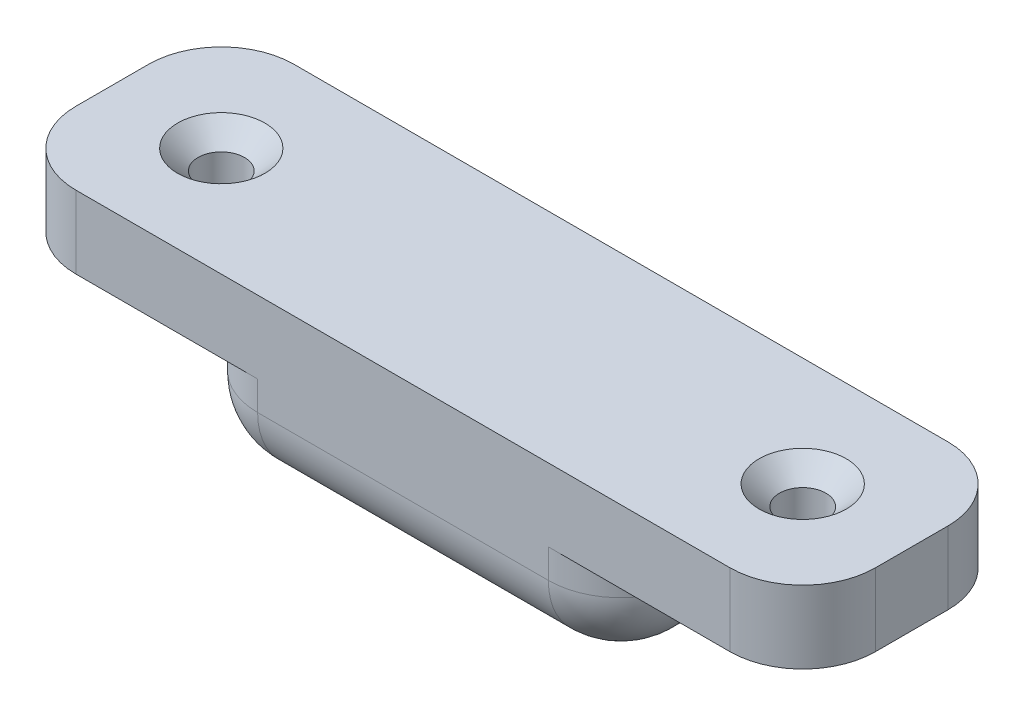
ISO-10303-21;
HEADER;
FILE_DESCRIPTION(('STEP AP214'),'2;1');
FILE_NAME('part.step','',(''),(''),'','','');
FILE_SCHEMA(('AUTOMOTIVE_DESIGN { 1 0 10303 214 1 1 1 1 }'));
ENDSEC;
DATA;
#1=APPLICATION_CONTEXT('core data for automotive mechanical design processes');
#2=APPLICATION_PROTOCOL_DEFINITION('international standard','automotive_design',2000,#1);
#3=PRODUCT_CONTEXT('',#1,'mechanical');
#4=PRODUCT('Part','Part','',(#3));
#5=PRODUCT_RELATED_PRODUCT_CATEGORY('part','',(#4));
#6=PRODUCT_DEFINITION_FORMATION('','',#4);
#7=PRODUCT_DEFINITION_CONTEXT('part definition',#1,'design');
#8=PRODUCT_DEFINITION('design','',#6,#7);
#9=PRODUCT_DEFINITION_SHAPE('','',#8);
#10=(LENGTH_UNIT() NAMED_UNIT(*) SI_UNIT(.MILLI.,.METRE.));
#11=(NAMED_UNIT(*) PLANE_ANGLE_UNIT() SI_UNIT($,.RADIAN.));
#12=(NAMED_UNIT(*) SI_UNIT($,.STERADIAN.) SOLID_ANGLE_UNIT());
#13=UNCERTAINTY_MEASURE_WITH_UNIT(LENGTH_MEASURE(1.E-05),#10,'distance_accuracy_value','');
#14=(GEOMETRIC_REPRESENTATION_CONTEXT(3) GLOBAL_UNCERTAINTY_ASSIGNED_CONTEXT((#13)) GLOBAL_UNIT_ASSIGNED_CONTEXT((#10,
#11,#12)) REPRESENTATION_CONTEXT('',''));
#15=CARTESIAN_POINT('',(0.,0.,0.));
#16=DIRECTION('',(0.,0.,1.));
#17=DIRECTION('',(1.,0.,0.));
#18=AXIS2_PLACEMENT_3D('',#15,#16,#17);
#19=CARTESIAN_POINT('',(-27.5,6.,15.));
#20=DIRECTION('',(1.,0.,0.));
#21=DIRECTION('',(0.,0.,-1.));
#22=AXIS2_PLACEMENT_3D('',#19,#20,#21);
#23=PLANE('',#22);
#24=DIRECTION('',(0.,0.,-1.));
#25=VECTOR('',#24,1.);
#26=CARTESIAN_POINT('',(-27.5,6.,15.));
#27=LINE('',#26,#25);
#28=CARTESIAN_POINT('',(-27.5,6.,10.));
#29=VERTEX_POINT('',#28);
#30=CARTESIAN_POINT('',(-27.5,6.,5.));
#31=VERTEX_POINT('',#30);
#32=EDGE_CURVE('E314',#29,#31,#27,.T.);
#33=ORIENTED_EDGE('',*,*,#32,.T.);
#34=DIRECTION('',(0.,-1.,0.));
#35=VECTOR('',#34,1.);
#36=CARTESIAN_POINT('',(-27.5,6.,5.));
#37=LINE('',#36,#35);
#38=CARTESIAN_POINT('',(-27.5,0.999999999999996,5.));
#39=VERTEX_POINT('',#38);
#40=EDGE_CURVE('E205',#31,#39,#37,.T.);
#41=ORIENTED_EDGE('',*,*,#40,.T.);
#42=DIRECTION('',(0.,0.,-1.));
#43=VECTOR('',#42,1.);
#44=CARTESIAN_POINT('',(-27.5,0.999999999999996,15.));
#45=LINE('',#44,#43);
#46=CARTESIAN_POINT('',(-27.5,0.999999999999996,10.));
#47=VERTEX_POINT('',#46);
#48=EDGE_CURVE('E329',#47,#39,#45,.T.);
#49=ORIENTED_EDGE('',*,*,#48,.F.);
#50=DIRECTION('',(0.,-1.,0.));
#51=VECTOR('',#50,1.);
#52=CARTESIAN_POINT('',(-27.5,6.,10.));
#53=LINE('',#52,#51);
#54=EDGE_CURVE('E203',#47,#29,#53,.F.);
#55=ORIENTED_EDGE('',*,*,#54,.T.);
#56=EDGE_LOOP('',(#33,#41,#49,#55));
#57=FACE_BOUND('',#56,.T.);
#58=ADVANCED_FACE('F34',(#57),#23,.F.);
#59=CARTESIAN_POINT('',(-27.5,0.999999999999996,15.));
#60=DIRECTION('',(0.,1.,0.));
#61=DIRECTION('',(0.,0.,1.));
#62=AXIS2_PLACEMENT_3D('',#59,#60,#61);
#63=PLANE('',#62);
#64=CARTESIAN_POINT('',(-20.,0.999999999999997,7.5));
#65=DIRECTION('',(0.,1.,0.));
#66=DIRECTION('',(0.,0.,1.));
#67=AXIS2_PLACEMENT_3D('',#64,#65,#66);
#68=CIRCLE('',#67,1.6);
#69=CARTESIAN_POINT('',(-20.,0.999999999999997,9.1));
#70=VERTEX_POINT('',#69);
#71=EDGE_CURVE('E297',#70,#70,#68,.T.);
#72=ORIENTED_EDGE('',*,*,#71,.T.);
#73=EDGE_LOOP('',(#72));
#74=FACE_BOUND('',#73,.T.);
#75=ORIENTED_EDGE('',*,*,#48,.T.);
#76=CARTESIAN_POINT('',(-22.5,0.999999999999997,5.));
#77=DIRECTION('',(0.,1.,0.));
#78=DIRECTION('',(0.,0.,1.));
#79=AXIS2_PLACEMENT_3D('',#76,#77,#78);
#80=CIRCLE('',#79,5.);
#81=CARTESIAN_POINT('',(-22.5,0.999999999999996,0.));
#82=VERTEX_POINT('',#81);
#83=EDGE_CURVE('E210',#39,#82,#80,.F.);
#84=ORIENTED_EDGE('',*,*,#83,.T.);
#85=DIRECTION('',(1.,0.,0.));
#86=VECTOR('',#85,1.);
#87=CARTESIAN_POINT('',(-27.5,0.999999999999996,0.));
#88=LINE('',#87,#86);
#89=CARTESIAN_POINT('',(-10.,0.999999999999996,0.));
#90=VERTEX_POINT('',#89);
#91=EDGE_CURVE('E315',#82,#90,#88,.T.);
#92=ORIENTED_EDGE('',*,*,#91,.T.);
#93=CARTESIAN_POINT('',(-10.,0.999999999999996,5.));
#94=DIRECTION('',(0.,1.,0.));
#95=DIRECTION('',(0.,0.,1.));
#96=AXIS2_PLACEMENT_3D('',#93,#94,#95);
#97=CIRCLE('',#96,5.);
#98=CARTESIAN_POINT('',(-15.,0.999999999999996,5.));
#99=VERTEX_POINT('',#98);
#100=EDGE_CURVE('E43',#90,#99,#97,.T.);
#101=ORIENTED_EDGE('',*,*,#100,.T.);
#102=DIRECTION('',(0.,0.,-1.));
#103=VECTOR('',#102,1.);
#104=CARTESIAN_POINT('',(-15.,0.999999999999996,15.));
#105=LINE('',#104,#103);
#106=CARTESIAN_POINT('',(-15.,0.999999999999996,10.));
#107=VERTEX_POINT('',#106);
#108=EDGE_CURVE('E182',#107,#99,#105,.T.);
#109=ORIENTED_EDGE('',*,*,#108,.F.);
#110=CARTESIAN_POINT('',(-10.,0.999999999999996,10.));
#111=DIRECTION('',(0.,1.,0.));
#112=DIRECTION('',(0.,0.,1.));
#113=AXIS2_PLACEMENT_3D('',#110,#111,#112);
#114=CIRCLE('',#113,5.);
#115=CARTESIAN_POINT('',(-10.,0.999999999999996,15.));
#116=VERTEX_POINT('',#115);
#117=EDGE_CURVE('E11',#107,#116,#114,.T.);
#118=ORIENTED_EDGE('',*,*,#117,.T.);
#119=DIRECTION('',(1.,0.,0.));
#120=VECTOR('',#119,1.);
#121=CARTESIAN_POINT('',(-27.5,0.999999999999996,15.));
#122=LINE('',#121,#120);
#123=CARTESIAN_POINT('',(-22.5,0.999999999999996,15.));
#124=VERTEX_POINT('',#123);
#125=EDGE_CURVE('E307',#124,#116,#122,.T.);
#126=ORIENTED_EDGE('',*,*,#125,.F.);
#127=CARTESIAN_POINT('',(-22.5,0.999999999999996,10.));
#128=DIRECTION('',(0.,1.,0.));
#129=DIRECTION('',(0.,0.,1.));
#130=AXIS2_PLACEMENT_3D('',#127,#128,#129);
#131=CIRCLE('',#130,5.);
#132=EDGE_CURVE('E208',#124,#47,#131,.F.);
#133=ORIENTED_EDGE('',*,*,#132,.T.);
#134=EDGE_LOOP('',(#75,#84,#92,#101,#109,#118,#126,#133));
#135=FACE_BOUND('',#134,.T.);
#136=ADVANCED_FACE('F337',(#74,#135),#63,.F.);
#137=CARTESIAN_POINT('',(-15.,0.999999999999996,15.));
#138=DIRECTION('',(1.,0.,0.));
#139=DIRECTION('',(0.,1.,0.));
#140=AXIS2_PLACEMENT_3D('',#137,#138,#139);
#141=PLANE('',#140);
#142=ORIENTED_EDGE('',*,*,#108,.T.);
#143=DIRECTION('',(0.,-1.,0.));
#144=VECTOR('',#143,1.);
#145=CARTESIAN_POINT('',(-15.,0.999999999999996,5.));
#146=LINE('',#145,#144);
#147=CARTESIAN_POINT('',(-15.,-1.,5.));
#148=VERTEX_POINT('',#147);
#149=EDGE_CURVE('E56',#99,#148,#146,.T.);
#150=ORIENTED_EDGE('',*,*,#149,.T.);
#151=DIRECTION('',(0.,0.,-1.));
#152=VECTOR('',#151,1.);
#153=CARTESIAN_POINT('',(-15.,-1.,15.));
#154=LINE('',#153,#152);
#155=CARTESIAN_POINT('',(-15.,-1.,10.));
#156=VERTEX_POINT('',#155);
#157=EDGE_CURVE('E51',#148,#156,#154,.F.);
#158=ORIENTED_EDGE('',*,*,#157,.T.);
#159=DIRECTION('',(0.,-1.,0.));
#160=VECTOR('',#159,1.);
#161=CARTESIAN_POINT('',(-15.,0.999999999999996,10.));
#162=LINE('',#161,#160);
#163=EDGE_CURVE('E253',#156,#107,#162,.F.);
#164=ORIENTED_EDGE('',*,*,#163,.T.);
#165=EDGE_LOOP('',(#142,#150,#158,#164));
#166=FACE_BOUND('',#165,.T.);
#167=ADVANCED_FACE('F362',(#166),#141,.F.);
#168=CARTESIAN_POINT('',(-15.,-6.,15.));
#169=DIRECTION('',(0.,1.,0.));
#170=DIRECTION('',(-1.,0.,0.));
#171=AXIS2_PLACEMENT_3D('',#168,#169,#170);
#172=PLANE('',#171);
#173=DIRECTION('',(1.,0.,0.));
#174=VECTOR('',#173,1.);
#175=CARTESIAN_POINT('',(-15.,-6.,5.));
#176=LINE('',#175,#174);
#177=CARTESIAN_POINT('',(-10.,-6.,5.));
#178=VERTEX_POINT('',#177);
#179=CARTESIAN_POINT('',(10.,-6.,5.));
#180=VERTEX_POINT('',#179);
#181=EDGE_CURVE('E198',#178,#180,#176,.T.);
#182=ORIENTED_EDGE('',*,*,#181,.T.);
#183=DIRECTION('',(0.,0.,-1.));
#184=VECTOR('',#183,1.);
#185=CARTESIAN_POINT('',(10.,-6.,15.));
#186=LINE('',#185,#184);
#187=CARTESIAN_POINT('',(10.,-6.,10.));
#188=VERTEX_POINT('',#187);
#189=EDGE_CURVE('E200',#180,#188,#186,.F.);
#190=ORIENTED_EDGE('',*,*,#189,.T.);
#191=DIRECTION('',(1.,0.,0.));
#192=VECTOR('',#191,1.);
#193=CARTESIAN_POINT('',(-15.,-6.,10.));
#194=LINE('',#193,#192);
#195=CARTESIAN_POINT('',(-10.,-6.,10.));
#196=VERTEX_POINT('',#195);
#197=EDGE_CURVE('E189',#188,#196,#194,.F.);
#198=ORIENTED_EDGE('',*,*,#197,.T.);
#199=DIRECTION('',(0.,0.,-1.));
#200=VECTOR('',#199,1.);
#201=CARTESIAN_POINT('',(-10.,-6.,15.));
#202=LINE('',#201,#200);
#203=EDGE_CURVE('E192',#196,#178,#202,.T.);
#204=ORIENTED_EDGE('',*,*,#203,.T.);
#205=EDGE_LOOP('',(#182,#190,#198,#204));
#206=FACE_BOUND('',#205,.T.);
#207=ADVANCED_FACE('F473',(#206),#172,.F.);
#208=CARTESIAN_POINT('',(15.,1.,15.));
#209=DIRECTION('',(-1.,0.,0.));
#210=DIRECTION('',(0.,-1.,0.));
#211=AXIS2_PLACEMENT_3D('',#208,#209,#210);
#212=PLANE('',#211);
#213=DIRECTION('',(0.,0.,-1.));
#214=VECTOR('',#213,1.);
#215=CARTESIAN_POINT('',(15.,1.,15.));
#216=LINE('',#215,#214);
#217=CARTESIAN_POINT('',(15.,1.,10.));
#218=VERTEX_POINT('',#217);
#219=CARTESIAN_POINT('',(15.,1.,5.));
#220=VERTEX_POINT('',#219);
#221=EDGE_CURVE('E165',#218,#220,#216,.T.);
#222=ORIENTED_EDGE('',*,*,#221,.F.);
#223=DIRECTION('',(0.,1.,0.));
#224=VECTOR('',#223,1.);
#225=CARTESIAN_POINT('',(15.,-6.,10.));
#226=LINE('',#225,#224);
#227=CARTESIAN_POINT('',(15.,-0.999999999999998,10.));
#228=VERTEX_POINT('',#227);
#229=EDGE_CURVE('E178',#218,#228,#226,.F.);
#230=ORIENTED_EDGE('',*,*,#229,.T.);
#231=DIRECTION('',(0.,0.,-1.));
#232=VECTOR('',#231,1.);
#233=CARTESIAN_POINT('',(15.,-0.999999999999998,15.));
#234=LINE('',#233,#232);
#235=CARTESIAN_POINT('',(15.,-0.999999999999998,5.));
#236=VERTEX_POINT('',#235);
#237=EDGE_CURVE('E190',#228,#236,#234,.T.);
#238=ORIENTED_EDGE('',*,*,#237,.T.);
#239=DIRECTION('',(0.,1.,0.));
#240=VECTOR('',#239,1.);
#241=CARTESIAN_POINT('',(15.,1.,5.));
#242=LINE('',#241,#240);
#243=EDGE_CURVE('E181',#236,#220,#242,.T.);
#244=ORIENTED_EDGE('',*,*,#243,.T.);
#245=EDGE_LOOP('',(#222,#230,#238,#244));
#246=FACE_BOUND('',#245,.T.);
#247=ADVANCED_FACE('F176',(#246),#212,.F.);
#248=CARTESIAN_POINT('',(27.5,1.,15.));
#249=DIRECTION('',(0.,1.,0.));
#250=DIRECTION('',(-1.,0.,0.));
#251=AXIS2_PLACEMENT_3D('',#248,#249,#250);
#252=PLANE('',#251);
#253=CARTESIAN_POINT('',(20.,1.,7.5));
#254=DIRECTION('',(0.,1.,0.));
#255=DIRECTION('',(-1.,0.,0.));
#256=AXIS2_PLACEMENT_3D('',#253,#254,#255);
#257=CIRCLE('',#256,1.6);
#258=CARTESIAN_POINT('',(18.4,1.,7.5));
#259=VERTEX_POINT('',#258);
#260=EDGE_CURVE('E306',#259,#259,#257,.T.);
#261=ORIENTED_EDGE('',*,*,#260,.T.);
#262=EDGE_LOOP('',(#261));
#263=FACE_BOUND('',#262,.T.);
#264=DIRECTION('',(1.,0.,0.));
#265=VECTOR('',#264,1.);
#266=CARTESIAN_POINT('',(27.5,1.,0.));
#267=LINE('',#266,#265);
#268=CARTESIAN_POINT('',(10.,0.999999999999999,0.));
#269=VERTEX_POINT('',#268);
#270=CARTESIAN_POINT('',(22.5,1.,0.));
#271=VERTEX_POINT('',#270);
#272=EDGE_CURVE('E317',#269,#271,#267,.T.);
#273=ORIENTED_EDGE('',*,*,#272,.T.);
#274=CARTESIAN_POINT('',(22.5,1.,5.));
#275=DIRECTION('',(0.,1.,0.));
#276=DIRECTION('',(-1.,0.,0.));
#277=AXIS2_PLACEMENT_3D('',#274,#275,#276);
#278=CIRCLE('',#277,5.);
#279=CARTESIAN_POINT('',(27.5,1.,5.));
#280=VERTEX_POINT('',#279);
#281=EDGE_CURVE('E250',#271,#280,#278,.F.);
#282=ORIENTED_EDGE('',*,*,#281,.T.);
#283=DIRECTION('',(0.,0.,-1.));
#284=VECTOR('',#283,1.);
#285=CARTESIAN_POINT('',(27.5,1.,15.));
#286=LINE('',#285,#284);
#287=CARTESIAN_POINT('',(27.5,1.,10.));
#288=VERTEX_POINT('',#287);
#289=EDGE_CURVE('E183',#288,#280,#286,.T.);
#290=ORIENTED_EDGE('',*,*,#289,.F.);
#291=CARTESIAN_POINT('',(22.5,1.,10.));
#292=DIRECTION('',(0.,1.,0.));
#293=DIRECTION('',(-1.,0.,0.));
#294=AXIS2_PLACEMENT_3D('',#291,#292,#293);
#295=CIRCLE('',#294,5.);
#296=CARTESIAN_POINT('',(22.5,1.,15.));
#297=VERTEX_POINT('',#296);
#298=EDGE_CURVE('E248',#288,#297,#295,.F.);
#299=ORIENTED_EDGE('',*,*,#298,.T.);
#300=DIRECTION('',(1.,0.,0.));
#301=VECTOR('',#300,1.);
#302=CARTESIAN_POINT('',(27.5,1.,15.));
#303=LINE('',#302,#301);
#304=CARTESIAN_POINT('',(10.,0.999999999999999,15.));
#305=VERTEX_POINT('',#304);
#306=EDGE_CURVE('E168',#305,#297,#303,.T.);
#307=ORIENTED_EDGE('',*,*,#306,.F.);
#308=CARTESIAN_POINT('',(10.,0.999999999999999,10.));
#309=DIRECTION('',(0.,1.,0.));
#310=DIRECTION('',(-1.,0.,0.));
#311=AXIS2_PLACEMENT_3D('',#308,#309,#310);
#312=CIRCLE('',#311,5.);
#313=EDGE_CURVE('E160',#305,#218,#312,.T.);
#314=ORIENTED_EDGE('',*,*,#313,.T.);
#315=ORIENTED_EDGE('',*,*,#221,.T.);
#316=CARTESIAN_POINT('',(10.,0.999999999999999,5.));
#317=DIRECTION('',(0.,1.,0.));
#318=DIRECTION('',(-1.,0.,0.));
#319=AXIS2_PLACEMENT_3D('',#316,#317,#318);
#320=CIRCLE('',#319,5.);
#321=EDGE_CURVE('E173',#220,#269,#320,.T.);
#322=ORIENTED_EDGE('',*,*,#321,.T.);
#323=EDGE_LOOP('',(#273,#282,#290,#299,#307,#314,#315,#322));
#324=FACE_BOUND('',#323,.T.);
#325=ADVANCED_FACE('F163',(#263,#324),#252,.F.);
#326=CARTESIAN_POINT('',(27.5,6.,15.));
#327=DIRECTION('',(-1.,0.,0.));
#328=DIRECTION('',(0.,0.,1.));
#329=AXIS2_PLACEMENT_3D('',#326,#327,#328);
#330=PLANE('',#329);
#331=ORIENTED_EDGE('',*,*,#289,.T.);
#332=DIRECTION('',(0.,1.,0.));
#333=VECTOR('',#332,1.);
#334=CARTESIAN_POINT('',(27.5,6.,5.));
#335=LINE('',#334,#333);
#336=CARTESIAN_POINT('',(27.5,6.,5.));
#337=VERTEX_POINT('',#336);
#338=EDGE_CURVE('E245',#280,#337,#335,.T.);
#339=ORIENTED_EDGE('',*,*,#338,.T.);
#340=DIRECTION('',(0.,0.,-1.));
#341=VECTOR('',#340,1.);
#342=CARTESIAN_POINT('',(27.5,6.,15.));
#343=LINE('',#342,#341);
#344=CARTESIAN_POINT('',(27.5,6.,10.));
#345=VERTEX_POINT('',#344);
#346=EDGE_CURVE('E323',#345,#337,#343,.T.);
#347=ORIENTED_EDGE('',*,*,#346,.F.);
#348=DIRECTION('',(0.,1.,0.));
#349=VECTOR('',#348,1.);
#350=CARTESIAN_POINT('',(27.5,1.,10.));
#351=LINE('',#350,#349);
#352=EDGE_CURVE('E243',#345,#288,#351,.F.);
#353=ORIENTED_EDGE('',*,*,#352,.T.);
#354=EDGE_LOOP('',(#331,#339,#347,#353));
#355=FACE_BOUND('',#354,.T.);
#356=ADVANCED_FACE('F430',(#355),#330,.F.);
#357=CARTESIAN_POINT('',(27.5,6.,15.));
#358=DIRECTION('',(0.,-1.,0.));
#359=DIRECTION('',(1.,0.,0.));
#360=AXIS2_PLACEMENT_3D('',#357,#358,#359);
#361=PLANE('',#360);
#362=CARTESIAN_POINT('',(-20.,6.,7.5));
#363=DIRECTION('',(0.,1.,0.));
#364=DIRECTION('',(0.,0.,1.));
#365=AXIS2_PLACEMENT_3D('',#362,#363,#364);
#366=CIRCLE('',#365,3.);
#367=CARTESIAN_POINT('',(-20.,6.,10.5));
#368=VERTEX_POINT('',#367);
#369=EDGE_CURVE('E289',#368,#368,#366,.T.);
#370=ORIENTED_EDGE('',*,*,#369,.F.);
#371=EDGE_LOOP('',(#370));
#372=FACE_BOUND('',#371,.T.);
#373=CARTESIAN_POINT('',(20.,6.,7.5));
#374=DIRECTION('',(0.,1.,0.));
#375=DIRECTION('',(0.,0.,1.));
#376=AXIS2_PLACEMENT_3D('',#373,#374,#375);
#377=CIRCLE('',#376,3.);
#378=CARTESIAN_POINT('',(20.,6.,10.5));
#379=VERTEX_POINT('',#378);
#380=EDGE_CURVE('E300',#379,#379,#377,.T.);
#381=ORIENTED_EDGE('',*,*,#380,.F.);
#382=EDGE_LOOP('',(#381));
#383=FACE_BOUND('',#382,.T.);
#384=DIRECTION('',(-1.,0.,0.));
#385=VECTOR('',#384,1.);
#386=CARTESIAN_POINT('',(27.5,6.,0.));
#387=LINE('',#386,#385);
#388=CARTESIAN_POINT('',(22.5,6.,0.));
#389=VERTEX_POINT('',#388);
#390=CARTESIAN_POINT('',(-22.5,6.,0.));
#391=VERTEX_POINT('',#390);
#392=EDGE_CURVE('E309',#389,#391,#387,.T.);
#393=ORIENTED_EDGE('',*,*,#392,.T.);
#394=CARTESIAN_POINT('',(-22.5,6.,5.));
#395=DIRECTION('',(0.,-1.,0.));
#396=DIRECTION('',(1.,0.,0.));
#397=AXIS2_PLACEMENT_3D('',#394,#395,#396);
#398=CIRCLE('',#397,5.);
#399=EDGE_CURVE('E229',#391,#31,#398,.F.);
#400=ORIENTED_EDGE('',*,*,#399,.T.);
#401=ORIENTED_EDGE('',*,*,#32,.F.);
#402=CARTESIAN_POINT('',(-22.5,6.,10.));
#403=DIRECTION('',(0.,-1.,0.));
#404=DIRECTION('',(1.,0.,0.));
#405=AXIS2_PLACEMENT_3D('',#402,#403,#404);
#406=CIRCLE('',#405,5.);
#407=CARTESIAN_POINT('',(-22.5,6.,15.));
#408=VERTEX_POINT('',#407);
#409=EDGE_CURVE('E227',#29,#408,#406,.F.);
#410=ORIENTED_EDGE('',*,*,#409,.T.);
#411=DIRECTION('',(-1.,0.,0.));
#412=VECTOR('',#411,1.);
#413=CARTESIAN_POINT('',(27.5,6.,15.));
#414=LINE('',#413,#412);
#415=CARTESIAN_POINT('',(22.5,6.,15.));
#416=VERTEX_POINT('',#415);
#417=EDGE_CURVE('E311',#416,#408,#414,.T.);
#418=ORIENTED_EDGE('',*,*,#417,.F.);
#419=CARTESIAN_POINT('',(22.5,6.,10.));
#420=DIRECTION('',(0.,-1.,0.));
#421=DIRECTION('',(1.,0.,0.));
#422=AXIS2_PLACEMENT_3D('',#419,#420,#421);
#423=CIRCLE('',#422,5.);
#424=EDGE_CURVE('E223',#416,#345,#423,.F.);
#425=ORIENTED_EDGE('',*,*,#424,.T.);
#426=ORIENTED_EDGE('',*,*,#346,.T.);
#427=CARTESIAN_POINT('',(22.5,6.,5.));
#428=DIRECTION('',(0.,-1.,0.));
#429=DIRECTION('',(1.,0.,0.));
#430=AXIS2_PLACEMENT_3D('',#427,#428,#429);
#431=CIRCLE('',#430,5.);
#432=EDGE_CURVE('E225',#337,#389,#431,.F.);
#433=ORIENTED_EDGE('',*,*,#432,.T.);
#434=EDGE_LOOP('',(#393,#400,#401,#410,#418,#425,#426,#433));
#435=FACE_BOUND('',#434,.T.);
#436=ADVANCED_FACE('F462',(#372,#383,#435),#361,.F.);
#437=CARTESIAN_POINT('',(0.,0.,15.));
#438=DIRECTION('',(0.,0.,1.));
#439=DIRECTION('',(1.,0.,0.));
#440=AXIS2_PLACEMENT_3D('',#437,#438,#439);
#441=PLANE('',#440);
#442=ORIENTED_EDGE('',*,*,#417,.T.);
#443=DIRECTION('',(0.,-1.,0.));
#444=VECTOR('',#443,1.);
#445=CARTESIAN_POINT('',(-22.5,0.999999999999996,15.));
#446=LINE('',#445,#444);
#447=EDGE_CURVE('E240',#408,#124,#446,.T.);
#448=ORIENTED_EDGE('',*,*,#447,.T.);
#449=ORIENTED_EDGE('',*,*,#125,.T.);
#450=DIRECTION('',(0.,-1.,0.));
#451=VECTOR('',#450,1.);
#452=CARTESIAN_POINT('',(-10.,-6.00000000000001,15.));
#453=LINE('',#452,#451);
#454=CARTESIAN_POINT('',(-10.,-1.,15.));
#455=VERTEX_POINT('',#454);
#456=EDGE_CURVE('E233',#116,#455,#453,.T.);
#457=ORIENTED_EDGE('',*,*,#456,.T.);
#458=DIRECTION('',(1.,0.,0.));
#459=VECTOR('',#458,1.);
#460=CARTESIAN_POINT('',(15.,-1.,15.));
#461=LINE('',#460,#459);
#462=CARTESIAN_POINT('',(10.,-1.,15.));
#463=VERTEX_POINT('',#462);
#464=EDGE_CURVE('E231',#455,#463,#461,.T.);
#465=ORIENTED_EDGE('',*,*,#464,.T.);
#466=DIRECTION('',(0.,1.,0.));
#467=VECTOR('',#466,1.);
#468=CARTESIAN_POINT('',(10.,0.999999999999996,15.));
#469=LINE('',#468,#467);
#470=EDGE_CURVE('E235',#463,#305,#469,.T.);
#471=ORIENTED_EDGE('',*,*,#470,.T.);
#472=ORIENTED_EDGE('',*,*,#306,.T.);
#473=DIRECTION('',(0.,1.,0.));
#474=VECTOR('',#473,1.);
#475=CARTESIAN_POINT('',(22.5,6.,15.));
#476=LINE('',#475,#474);
#477=EDGE_CURVE('E237',#297,#416,#476,.T.);
#478=ORIENTED_EDGE('',*,*,#477,.T.);
#479=EDGE_LOOP('',(#442,#448,#449,#457,#465,#471,#472,#478));
#480=FACE_BOUND('',#479,.T.);
#481=ADVANCED_FACE('F435',(#480),#441,.T.);
#482=CARTESIAN_POINT('',(0.,0.,0.));
#483=DIRECTION('',(0.,0.,1.));
#484=DIRECTION('',(1.,0.,0.));
#485=AXIS2_PLACEMENT_3D('',#482,#483,#484);
#486=PLANE('',#485);
#487=ORIENTED_EDGE('',*,*,#91,.F.);
#488=DIRECTION('',(0.,-1.,0.));
#489=VECTOR('',#488,1.);
#490=CARTESIAN_POINT('',(-22.5,0.,0.));
#491=LINE('',#490,#489);
#492=EDGE_CURVE('E221',#82,#391,#491,.F.);
#493=ORIENTED_EDGE('',*,*,#492,.T.);
#494=ORIENTED_EDGE('',*,*,#392,.F.);
#495=DIRECTION('',(0.,1.,0.));
#496=VECTOR('',#495,1.);
#497=CARTESIAN_POINT('',(22.5,0.,0.));
#498=LINE('',#497,#496);
#499=EDGE_CURVE('E219',#389,#271,#498,.F.);
#500=ORIENTED_EDGE('',*,*,#499,.T.);
#501=ORIENTED_EDGE('',*,*,#272,.F.);
#502=DIRECTION('',(0.,1.,0.));
#503=VECTOR('',#502,1.);
#504=CARTESIAN_POINT('',(10.,0.,0.));
#505=LINE('',#504,#503);
#506=CARTESIAN_POINT('',(10.,-1.,0.));
#507=VERTEX_POINT('',#506);
#508=EDGE_CURVE('E217',#269,#507,#505,.F.);
#509=ORIENTED_EDGE('',*,*,#508,.T.);
#510=DIRECTION('',(1.,0.,0.));
#511=VECTOR('',#510,1.);
#512=CARTESIAN_POINT('',(0.,-1.,0.));
#513=LINE('',#512,#511);
#514=CARTESIAN_POINT('',(-10.,-1.,0.));
#515=VERTEX_POINT('',#514);
#516=EDGE_CURVE('E212',#507,#515,#513,.F.);
#517=ORIENTED_EDGE('',*,*,#516,.T.);
#518=DIRECTION('',(0.,-1.,0.));
#519=VECTOR('',#518,1.);
#520=CARTESIAN_POINT('',(-10.,0.,0.));
#521=LINE('',#520,#519);
#522=EDGE_CURVE('E214',#515,#90,#521,.F.);
#523=ORIENTED_EDGE('',*,*,#522,.T.);
#524=EDGE_LOOP('',(#487,#493,#494,#500,#501,#509,#517,#523));
#525=FACE_BOUND('',#524,.T.);
#526=ADVANCED_FACE('F449',(#525),#486,.F.);
#527=CARTESIAN_POINT('',(20.,6.,7.5));
#528=DIRECTION('',(0.,1.,0.));
#529=DIRECTION('',(0.,0.,1.));
#530=AXIS2_PLACEMENT_3D('',#527,#528,#529);
#531=CYLINDRICAL_SURFACE('',#530,1.6);
#532=CARTESIAN_POINT('',(20.,4.64803571527009,7.5));
#533=DIRECTION('',(0.,1.,0.));
#534=DIRECTION('',(0.,0.,1.));
#535=AXIS2_PLACEMENT_3D('',#532,#533,#534);
#536=CIRCLE('',#535,1.6);
#537=CARTESIAN_POINT('',(20.,4.64803571527009,9.1));
#538=VERTEX_POINT('',#537);
#539=EDGE_CURVE('E303',#538,#538,#536,.T.);
#540=ORIENTED_EDGE('',*,*,#539,.T.);
#541=EDGE_LOOP('',(#540));
#542=FACE_BOUND('',#541,.T.);
#543=ORIENTED_EDGE('',*,*,#260,.F.);
#544=EDGE_LOOP('',(#543));
#545=FACE_BOUND('',#544,.T.);
#546=ADVANCED_FACE('F353',(#542,#545),#531,.F.);
#547=CARTESIAN_POINT('',(20.,6.,7.5));
#548=DIRECTION('',(0.,1.,0.));
#549=DIRECTION('',(0.,0.,1.));
#550=AXIS2_PLACEMENT_3D('',#547,#548,#549);
#551=CONICAL_SURFACE('',#550,3.,0.802851455917391);
#552=ORIENTED_EDGE('',*,*,#539,.F.);
#553=EDGE_LOOP('',(#552));
#554=FACE_BOUND('',#553,.T.);
#555=ORIENTED_EDGE('',*,*,#380,.T.);
#556=EDGE_LOOP('',(#555));
#557=FACE_BOUND('',#556,.T.);
#558=ADVANCED_FACE('F343',(#554,#557),#551,.F.);
#559=CARTESIAN_POINT('',(-20.,6.,7.5));
#560=DIRECTION('',(0.,1.,0.));
#561=DIRECTION('',(0.,0.,1.));
#562=AXIS2_PLACEMENT_3D('',#559,#560,#561);
#563=CYLINDRICAL_SURFACE('',#562,1.6);
#564=CARTESIAN_POINT('',(-20.,4.64803571527009,7.5));
#565=DIRECTION('',(0.,1.,0.));
#566=DIRECTION('',(0.,0.,1.));
#567=AXIS2_PLACEMENT_3D('',#564,#565,#566);
#568=CIRCLE('',#567,1.6);
#569=CARTESIAN_POINT('',(-20.,4.64803571527009,9.1));
#570=VERTEX_POINT('',#569);
#571=EDGE_CURVE('E292',#570,#570,#568,.T.);
#572=ORIENTED_EDGE('',*,*,#571,.T.);
#573=EDGE_LOOP('',(#572));
#574=FACE_BOUND('',#573,.T.);
#575=ORIENTED_EDGE('',*,*,#71,.F.);
#576=EDGE_LOOP('',(#575));
#577=FACE_BOUND('',#576,.T.);
#578=ADVANCED_FACE('F340',(#574,#577),#563,.F.);
#579=CARTESIAN_POINT('',(-20.,6.,7.5));
#580=DIRECTION('',(0.,1.,0.));
#581=DIRECTION('',(0.,0.,1.));
#582=AXIS2_PLACEMENT_3D('',#579,#580,#581);
#583=CONICAL_SURFACE('',#582,3.,0.802851455917391);
#584=ORIENTED_EDGE('',*,*,#571,.F.);
#585=EDGE_LOOP('',(#584));
#586=FACE_BOUND('',#585,.T.);
#587=ORIENTED_EDGE('',*,*,#369,.T.);
#588=EDGE_LOOP('',(#587));
#589=FACE_BOUND('',#588,.T.);
#590=ADVANCED_FACE('F342',(#586,#589),#583,.F.);
#591=CARTESIAN_POINT('',(-10.,0.,10.));
#592=DIRECTION('',(0.,1.,0.));
#593=DIRECTION('',(-1.,0.,0.));
#594=AXIS2_PLACEMENT_3D('',#591,#592,#593);
#595=CYLINDRICAL_SURFACE('',#594,5.);
#596=ORIENTED_EDGE('',*,*,#117,.F.);
#597=ORIENTED_EDGE('',*,*,#163,.F.);
#598=CARTESIAN_POINT('',(-10.,-1.,10.));
#599=DIRECTION('',(0.,-1.,0.));
#600=DIRECTION('',(1.,0.,0.));
#601=AXIS2_PLACEMENT_3D('',#598,#599,#600);
#602=CIRCLE('',#601,5.);
#603=EDGE_CURVE('E283',#455,#156,#602,.T.);
#604=ORIENTED_EDGE('',*,*,#603,.F.);
#605=ORIENTED_EDGE('',*,*,#456,.F.);
#606=EDGE_LOOP('',(#596,#597,#604,#605));
#607=FACE_BOUND('',#606,.T.);
#608=ADVANCED_FACE('F350',(#607),#595,.T.);
#609=CARTESIAN_POINT('',(-10.,0.999999999999995,5.));
#610=DIRECTION('',(0.,-1.,0.));
#611=DIRECTION('',(1.,0.,0.));
#612=AXIS2_PLACEMENT_3D('',#609,#610,#611);
#613=CYLINDRICAL_SURFACE('',#612,5.);
#614=ORIENTED_EDGE('',*,*,#100,.F.);
#615=ORIENTED_EDGE('',*,*,#522,.F.);
#616=CARTESIAN_POINT('',(-10.,-1.,5.));
#617=DIRECTION('',(0.,-1.,0.));
#618=DIRECTION('',(1.,0.,0.));
#619=AXIS2_PLACEMENT_3D('',#616,#617,#618);
#620=CIRCLE('',#619,5.);
#621=EDGE_CURVE('E281',#148,#515,#620,.T.);
#622=ORIENTED_EDGE('',*,*,#621,.F.);
#623=ORIENTED_EDGE('',*,*,#149,.F.);
#624=EDGE_LOOP('',(#614,#615,#622,#623));
#625=FACE_BOUND('',#624,.T.);
#626=ADVANCED_FACE('F403',(#625),#613,.T.);
#627=CARTESIAN_POINT('',(-10.,-1.,15.));
#628=DIRECTION('',(0.,0.,-1.));
#629=DIRECTION('',(-1.,0.,0.));
#630=AXIS2_PLACEMENT_3D('',#627,#628,#629);
#631=CYLINDRICAL_SURFACE('',#630,5.);
#632=CARTESIAN_POINT('',(-10.,-1.,10.));
#633=DIRECTION('',(0.,0.,1.));
#634=DIRECTION('',(1.,0.,0.));
#635=AXIS2_PLACEMENT_3D('',#632,#633,#634);
#636=CIRCLE('',#635,5.);
#637=EDGE_CURVE('E38',#156,#196,#636,.T.);
#638=ORIENTED_EDGE('',*,*,#637,.F.);
#639=ORIENTED_EDGE('',*,*,#157,.F.);
#640=CARTESIAN_POINT('',(-10.,-1.,5.));
#641=DIRECTION('',(0.,0.,-1.));
#642=DIRECTION('',(-1.,0.,0.));
#643=AXIS2_PLACEMENT_3D('',#640,#641,#642);
#644=CIRCLE('',#643,5.);
#645=EDGE_CURVE('E278',#178,#148,#644,.T.);
#646=ORIENTED_EDGE('',*,*,#645,.F.);
#647=ORIENTED_EDGE('',*,*,#203,.F.);
#648=EDGE_LOOP('',(#638,#639,#646,#647));
#649=FACE_BOUND('',#648,.T.);
#650=ADVANCED_FACE('F400',(#649),#631,.T.);
#651=CARTESIAN_POINT('',(-10.,-1.,10.));
#652=DIRECTION('',(0.,0.,1.));
#653=DIRECTION('',(1.,0.,0.));
#654=AXIS2_PLACEMENT_3D('',#651,#652,#653);
#655=SPHERICAL_SURFACE('',#654,5.);
#656=ORIENTED_EDGE('',*,*,#603,.T.);
#657=ORIENTED_EDGE('',*,*,#637,.T.);
#658=CARTESIAN_POINT('',(-10.,-1.,10.));
#659=DIRECTION('',(-1.,0.,0.));
#660=DIRECTION('',(0.,0.,1.));
#661=AXIS2_PLACEMENT_3D('',#658,#659,#660);
#662=CIRCLE('',#661,5.);
#663=EDGE_CURVE('E275',#455,#196,#662,.F.);
#664=ORIENTED_EDGE('',*,*,#663,.F.);
#665=EDGE_LOOP('',(#656,#657,#664));
#666=FACE_BOUND('',#665,.T.);
#667=ADVANCED_FACE('F396',(#666),#655,.T.);
#668=CARTESIAN_POINT('',(-10.,-1.,5.));
#669=DIRECTION('',(0.,0.,1.));
#670=DIRECTION('',(1.,0.,0.));
#671=AXIS2_PLACEMENT_3D('',#668,#669,#670);
#672=SPHERICAL_SURFACE('',#671,5.);
#673=ORIENTED_EDGE('',*,*,#645,.T.);
#674=ORIENTED_EDGE('',*,*,#621,.T.);
#675=CARTESIAN_POINT('',(-10.,-1.,5.));
#676=DIRECTION('',(-1.,0.,0.));
#677=DIRECTION('',(0.,0.,1.));
#678=AXIS2_PLACEMENT_3D('',#675,#676,#677);
#679=CIRCLE('',#678,5.);
#680=EDGE_CURVE('E272',#178,#515,#679,.F.);
#681=ORIENTED_EDGE('',*,*,#680,.F.);
#682=EDGE_LOOP('',(#673,#674,#681));
#683=FACE_BOUND('',#682,.T.);
#684=ADVANCED_FACE('F392',(#683),#672,.T.);
#685=CARTESIAN_POINT('',(0.,-1.,10.));
#686=DIRECTION('',(-1.,0.,0.));
#687=DIRECTION('',(0.,-1.,0.));
#688=AXIS2_PLACEMENT_3D('',#685,#686,#687);
#689=CYLINDRICAL_SURFACE('',#688,5.);
#690=ORIENTED_EDGE('',*,*,#663,.T.);
#691=ORIENTED_EDGE('',*,*,#197,.F.);
#692=CARTESIAN_POINT('',(10.,-1.,10.));
#693=DIRECTION('',(1.,0.,0.));
#694=DIRECTION('',(0.,0.,-1.));
#695=AXIS2_PLACEMENT_3D('',#692,#693,#694);
#696=CIRCLE('',#695,5.);
#697=EDGE_CURVE('E269',#463,#188,#696,.T.);
#698=ORIENTED_EDGE('',*,*,#697,.F.);
#699=ORIENTED_EDGE('',*,*,#464,.F.);
#700=EDGE_LOOP('',(#690,#691,#698,#699));
#701=FACE_BOUND('',#700,.T.);
#702=ADVANCED_FACE('F389',(#701),#689,.T.);
#703=CARTESIAN_POINT('',(10.,0.,10.));
#704=DIRECTION('',(0.,-1.,0.));
#705=DIRECTION('',(1.,0.,0.));
#706=AXIS2_PLACEMENT_3D('',#703,#704,#705);
#707=CYLINDRICAL_SURFACE('',#706,5.);
#708=ORIENTED_EDGE('',*,*,#313,.F.);
#709=ORIENTED_EDGE('',*,*,#470,.F.);
#710=CARTESIAN_POINT('',(10.,-1.,10.));
#711=DIRECTION('',(0.,-1.,0.));
#712=DIRECTION('',(1.,0.,0.));
#713=AXIS2_PLACEMENT_3D('',#710,#711,#712);
#714=CIRCLE('',#713,5.);
#715=EDGE_CURVE('E187',#228,#463,#714,.T.);
#716=ORIENTED_EDGE('',*,*,#715,.F.);
#717=ORIENTED_EDGE('',*,*,#229,.F.);
#718=EDGE_LOOP('',(#708,#709,#716,#717));
#719=FACE_BOUND('',#718,.T.);
#720=ADVANCED_FACE('F185',(#719),#707,.T.);
#721=CARTESIAN_POINT('',(10.,0.999999999999996,5.));
#722=DIRECTION('',(0.,1.,0.));
#723=DIRECTION('',(-1.,0.,0.));
#724=AXIS2_PLACEMENT_3D('',#721,#722,#723);
#725=CYLINDRICAL_SURFACE('',#724,5.);
#726=ORIENTED_EDGE('',*,*,#321,.F.);
#727=ORIENTED_EDGE('',*,*,#243,.F.);
#728=CARTESIAN_POINT('',(10.,-1.,5.));
#729=DIRECTION('',(0.,-1.,0.));
#730=DIRECTION('',(1.,0.,0.));
#731=AXIS2_PLACEMENT_3D('',#728,#729,#730);
#732=CIRCLE('',#731,5.);
#733=EDGE_CURVE('E265',#507,#236,#732,.T.);
#734=ORIENTED_EDGE('',*,*,#733,.F.);
#735=ORIENTED_EDGE('',*,*,#508,.F.);
#736=EDGE_LOOP('',(#726,#727,#734,#735));
#737=FACE_BOUND('',#736,.T.);
#738=ADVANCED_FACE('F382',(#737),#725,.T.);
#739=CARTESIAN_POINT('',(-15.,-1.,5.));
#740=DIRECTION('',(1.,0.,0.));
#741=DIRECTION('',(0.,1.,0.));
#742=AXIS2_PLACEMENT_3D('',#739,#740,#741);
#743=CYLINDRICAL_SURFACE('',#742,5.);
#744=ORIENTED_EDGE('',*,*,#680,.T.);
#745=ORIENTED_EDGE('',*,*,#516,.F.);
#746=CARTESIAN_POINT('',(10.,-1.,5.));
#747=DIRECTION('',(1.,0.,0.));
#748=DIRECTION('',(0.,0.,-1.));
#749=AXIS2_PLACEMENT_3D('',#746,#747,#748);
#750=CIRCLE('',#749,5.);
#751=EDGE_CURVE('E262',#180,#507,#750,.T.);
#752=ORIENTED_EDGE('',*,*,#751,.F.);
#753=ORIENTED_EDGE('',*,*,#181,.F.);
#754=EDGE_LOOP('',(#744,#745,#752,#753));
#755=FACE_BOUND('',#754,.T.);
#756=ADVANCED_FACE('F378',(#755),#743,.T.);
#757=CARTESIAN_POINT('',(10.,-1.,10.));
#758=DIRECTION('',(0.,0.,1.));
#759=DIRECTION('',(1.,0.,0.));
#760=AXIS2_PLACEMENT_3D('',#757,#758,#759);
#761=SPHERICAL_SURFACE('',#760,5.);
#762=ORIENTED_EDGE('',*,*,#715,.T.);
#763=ORIENTED_EDGE('',*,*,#697,.T.);
#764=CARTESIAN_POINT('',(10.,-1.,10.));
#765=DIRECTION('',(0.,0.,1.));
#766=DIRECTION('',(1.,0.,0.));
#767=AXIS2_PLACEMENT_3D('',#764,#765,#766);
#768=CIRCLE('',#767,5.);
#769=EDGE_CURVE('E260',#228,#188,#768,.F.);
#770=ORIENTED_EDGE('',*,*,#769,.F.);
#771=EDGE_LOOP('',(#762,#763,#770));
#772=FACE_BOUND('',#771,.T.);
#773=ADVANCED_FACE('F374',(#772),#761,.T.);
#774=CARTESIAN_POINT('',(10.,-1.,5.));
#775=DIRECTION('',(0.,0.,1.));
#776=DIRECTION('',(1.,0.,0.));
#777=AXIS2_PLACEMENT_3D('',#774,#775,#776);
#778=SPHERICAL_SURFACE('',#777,5.);
#779=ORIENTED_EDGE('',*,*,#751,.T.);
#780=ORIENTED_EDGE('',*,*,#733,.T.);
#781=CARTESIAN_POINT('',(10.,-1.,5.));
#782=DIRECTION('',(0.,0.,-1.));
#783=DIRECTION('',(-1.,0.,0.));
#784=AXIS2_PLACEMENT_3D('',#781,#782,#783);
#785=CIRCLE('',#784,5.);
#786=EDGE_CURVE('E258',#180,#236,#785,.F.);
#787=ORIENTED_EDGE('',*,*,#786,.F.);
#788=EDGE_LOOP('',(#779,#780,#787));
#789=FACE_BOUND('',#788,.T.);
#790=ADVANCED_FACE('F370',(#789),#778,.T.);
#791=CARTESIAN_POINT('',(10.,-1.,15.));
#792=DIRECTION('',(0.,0.,-1.));
#793=DIRECTION('',(-1.,0.,0.));
#794=AXIS2_PLACEMENT_3D('',#791,#792,#793);
#795=CYLINDRICAL_SURFACE('',#794,5.);
#796=ORIENTED_EDGE('',*,*,#769,.T.);
#797=ORIENTED_EDGE('',*,*,#189,.F.);
#798=ORIENTED_EDGE('',*,*,#786,.T.);
#799=ORIENTED_EDGE('',*,*,#237,.F.);
#800=EDGE_LOOP('',(#796,#797,#798,#799));
#801=FACE_BOUND('',#800,.T.);
#802=ADVANCED_FACE('F366',(#801),#795,.T.);
#803=CARTESIAN_POINT('',(-22.5,6.,5.));
#804=DIRECTION('',(0.,-1.,0.));
#805=DIRECTION('',(0.,0.,-1.));
#806=AXIS2_PLACEMENT_3D('',#803,#804,#805);
#807=CYLINDRICAL_SURFACE('',#806,5.);
#808=ORIENTED_EDGE('',*,*,#399,.F.);
#809=ORIENTED_EDGE('',*,*,#492,.F.);
#810=ORIENTED_EDGE('',*,*,#83,.F.);
#811=ORIENTED_EDGE('',*,*,#40,.F.);
#812=EDGE_LOOP('',(#808,#809,#810,#811));
#813=FACE_BOUND('',#812,.T.);
#814=ADVANCED_FACE('F369',(#813),#807,.T.);
#815=CARTESIAN_POINT('',(-22.5,0.,10.));
#816=DIRECTION('',(0.,1.,0.));
#817=DIRECTION('',(0.,0.,1.));
#818=AXIS2_PLACEMENT_3D('',#815,#816,#817);
#819=CYLINDRICAL_SURFACE('',#818,5.);
#820=ORIENTED_EDGE('',*,*,#409,.F.);
#821=ORIENTED_EDGE('',*,*,#54,.F.);
#822=ORIENTED_EDGE('',*,*,#132,.F.);
#823=ORIENTED_EDGE('',*,*,#447,.F.);
#824=EDGE_LOOP('',(#820,#821,#822,#823));
#825=FACE_BOUND('',#824,.T.);
#826=ADVANCED_FACE('F413',(#825),#819,.T.);
#827=CARTESIAN_POINT('',(22.5,6.,5.));
#828=DIRECTION('',(0.,1.,0.));
#829=DIRECTION('',(0.,0.,1.));
#830=AXIS2_PLACEMENT_3D('',#827,#828,#829);
#831=CYLINDRICAL_SURFACE('',#830,5.);
#832=ORIENTED_EDGE('',*,*,#281,.F.);
#833=ORIENTED_EDGE('',*,*,#499,.F.);
#834=ORIENTED_EDGE('',*,*,#432,.F.);
#835=ORIENTED_EDGE('',*,*,#338,.F.);
#836=EDGE_LOOP('',(#832,#833,#834,#835));
#837=FACE_BOUND('',#836,.T.);
#838=ADVANCED_FACE('F416',(#837),#831,.T.);
#839=CARTESIAN_POINT('',(22.5,0.,10.));
#840=DIRECTION('',(0.,-1.,0.));
#841=DIRECTION('',(0.,0.,-1.));
#842=AXIS2_PLACEMENT_3D('',#839,#840,#841);
#843=CYLINDRICAL_SURFACE('',#842,5.);
#844=ORIENTED_EDGE('',*,*,#298,.F.);
#845=ORIENTED_EDGE('',*,*,#352,.F.);
#846=ORIENTED_EDGE('',*,*,#424,.F.);
#847=ORIENTED_EDGE('',*,*,#477,.F.);
#848=EDGE_LOOP('',(#844,#845,#846,#847));
#849=FACE_BOUND('',#848,.T.);
#850=ADVANCED_FACE('F36',(#849),#843,.T.);
#851=CLOSED_SHELL('',(#58,#136,#167,#207,#247,#325,#356,#436,#481,#526,#546,#558,#578,#590,#608,
#626,#650,#667,#684,#702,#720,#738,#756,#773,#790,#802,#814,#826,#838,#850));
#852=MANIFOLD_SOLID_BREP('B2',#851);
#853=ADVANCED_BREP_SHAPE_REPRESENTATION('',(#18,#852),#14);
#854=SHAPE_DEFINITION_REPRESENTATION(#9,#853);
ENDSEC;
END-ISO-10303-21;
